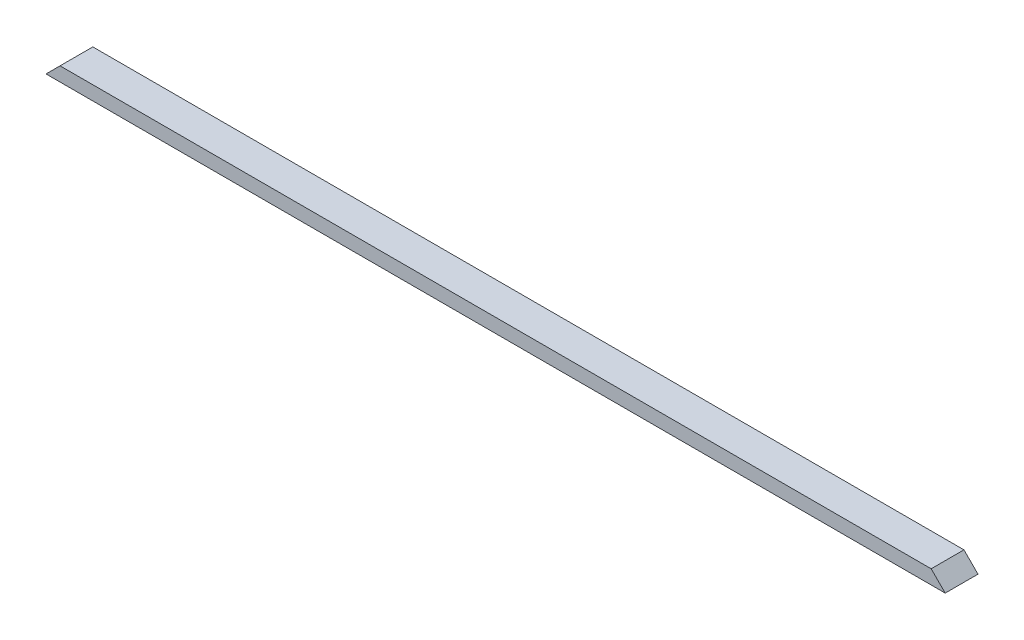
ISO-10303-21;
HEADER;
FILE_DESCRIPTION(('STEP AP214'),'2;1');
FILE_NAME('part.step','',(''),(''),'','','');
FILE_SCHEMA(('AUTOMOTIVE_DESIGN { 1 0 10303 214 1 1 1 1 }'));
ENDSEC;
DATA;
#1=APPLICATION_CONTEXT('core data for automotive mechanical design processes');
#2=APPLICATION_PROTOCOL_DEFINITION('international standard','automotive_design',2000,#1);
#3=PRODUCT_CONTEXT('',#1,'mechanical');
#4=PRODUCT('Part','Part','',(#3));
#5=PRODUCT_RELATED_PRODUCT_CATEGORY('part','',(#4));
#6=PRODUCT_DEFINITION_FORMATION('','',#4);
#7=PRODUCT_DEFINITION_CONTEXT('part definition',#1,'design');
#8=PRODUCT_DEFINITION('design','',#6,#7);
#9=PRODUCT_DEFINITION_SHAPE('','',#8);
#10=(LENGTH_UNIT() NAMED_UNIT(*) SI_UNIT(.MILLI.,.METRE.));
#11=(NAMED_UNIT(*) PLANE_ANGLE_UNIT() SI_UNIT($,.RADIAN.));
#12=(NAMED_UNIT(*) SI_UNIT($,.STERADIAN.) SOLID_ANGLE_UNIT());
#13=UNCERTAINTY_MEASURE_WITH_UNIT(LENGTH_MEASURE(1.E-05),#10,'distance_accuracy_value','');
#14=(GEOMETRIC_REPRESENTATION_CONTEXT(3) GLOBAL_UNCERTAINTY_ASSIGNED_CONTEXT((#13)) GLOBAL_UNIT_ASSIGNED_CONTEXT((#10,
#11,#12)) REPRESENTATION_CONTEXT('',''));
#15=CARTESIAN_POINT('',(0.,0.,0.));
#16=DIRECTION('',(0.,0.,1.));
#17=DIRECTION('',(1.,0.,0.));
#18=AXIS2_PLACEMENT_3D('',#15,#16,#17);
#19=CARTESIAN_POINT('',(0.,38.1,0.));
#20=DIRECTION('',(0.,0.,-1.));
#21=DIRECTION('',(-1.,0.,0.));
#22=AXIS2_PLACEMENT_3D('',#19,#20,#21);
#23=PLANE('',#22);
#24=DIRECTION('',(1.,0.,0.));
#25=VECTOR('',#24,1.);
#26=CARTESIAN_POINT('',(0.,38.1,0.));
#27=LINE('',#26,#25);
#28=CARTESIAN_POINT('',(38.1,38.1,0.));
#29=VERTEX_POINT('',#28);
#30=CARTESIAN_POINT('',(2400.3,38.1000000000001,0.));
#31=VERTEX_POINT('',#30);
#32=EDGE_CURVE('E46',#29,#31,#27,.T.);
#33=ORIENTED_EDGE('',*,*,#32,.F.);
#34=DIRECTION('',(0.707106781186547,0.707106781186547,0.));
#35=VECTOR('',#34,1.);
#36=CARTESIAN_POINT('',(0.,0.,0.));
#37=LINE('',#36,#35);
#38=CARTESIAN_POINT('',(0.,0.,0.));
#39=VERTEX_POINT('',#38);
#40=EDGE_CURVE('E81',#39,#29,#37,.T.);
#41=ORIENTED_EDGE('',*,*,#40,.F.);
#42=DIRECTION('',(1.,0.,0.));
#43=VECTOR('',#42,1.);
#44=CARTESIAN_POINT('',(0.,0.,0.));
#45=LINE('',#44,#43);
#46=CARTESIAN_POINT('',(2438.4,0.,0.));
#47=VERTEX_POINT('',#46);
#48=EDGE_CURVE('E86',#39,#47,#45,.T.);
#49=ORIENTED_EDGE('',*,*,#48,.T.);
#50=DIRECTION('',(0.707106781186547,-0.707106781186548,0.));
#51=VECTOR('',#50,1.);
#52=CARTESIAN_POINT('',(2400.3,38.1000000000001,0.));
#53=LINE('',#52,#51);
#54=EDGE_CURVE('E62',#31,#47,#53,.T.);
#55=ORIENTED_EDGE('',*,*,#54,.F.);
#56=EDGE_LOOP('',(#33,#41,#49,#55));
#57=FACE_BOUND('',#56,.T.);
#58=ADVANCED_FACE('F38',(#57),#23,.F.);
#59=CARTESIAN_POINT('',(0.,38.1,-88.9));
#60=DIRECTION('',(0.,0.,1.));
#61=DIRECTION('',(1.,0.,0.));
#62=AXIS2_PLACEMENT_3D('',#59,#60,#61);
#63=PLANE('',#62);
#64=DIRECTION('',(-1.,0.,0.));
#65=VECTOR('',#64,1.);
#66=CARTESIAN_POINT('',(0.,0.,-88.9));
#67=LINE('',#66,#65);
#68=CARTESIAN_POINT('',(2438.4,0.,-88.9));
#69=VERTEX_POINT('',#68);
#70=CARTESIAN_POINT('',(0.,0.,-88.9));
#71=VERTEX_POINT('',#70);
#72=EDGE_CURVE('E41',#69,#71,#67,.T.);
#73=ORIENTED_EDGE('',*,*,#72,.T.);
#74=DIRECTION('',(0.707106781186547,0.707106781186547,0.));
#75=VECTOR('',#74,1.);
#76=CARTESIAN_POINT('',(0.,0.,-88.9));
#77=LINE('',#76,#75);
#78=CARTESIAN_POINT('',(38.1,38.1,-88.9));
#79=VERTEX_POINT('',#78);
#80=EDGE_CURVE('E54',#71,#79,#77,.T.);
#81=ORIENTED_EDGE('',*,*,#80,.T.);
#82=DIRECTION('',(-1.,0.,0.));
#83=VECTOR('',#82,1.);
#84=CARTESIAN_POINT('',(0.,38.1,-88.9));
#85=LINE('',#84,#83);
#86=CARTESIAN_POINT('',(2400.3,38.1000000000001,-88.9));
#87=VERTEX_POINT('',#86);
#88=EDGE_CURVE('E11',#87,#79,#85,.T.);
#89=ORIENTED_EDGE('',*,*,#88,.F.);
#90=DIRECTION('',(0.707106781186547,-0.707106781186548,0.));
#91=VECTOR('',#90,1.);
#92=CARTESIAN_POINT('',(2400.3,38.1000000000001,-88.9));
#93=LINE('',#92,#91);
#94=EDGE_CURVE('E99',#87,#69,#93,.T.);
#95=ORIENTED_EDGE('',*,*,#94,.T.);
#96=EDGE_LOOP('',(#73,#81,#89,#95));
#97=FACE_BOUND('',#96,.T.);
#98=ADVANCED_FACE('F108',(#97),#63,.F.);
#99=CARTESIAN_POINT('',(0.,38.1,0.));
#100=DIRECTION('',(0.,-1.,0.));
#101=DIRECTION('',(0.,0.,-1.));
#102=AXIS2_PLACEMENT_3D('',#99,#100,#101);
#103=PLANE('',#102);
#104=ORIENTED_EDGE('',*,*,#88,.T.);
#105=DIRECTION('',(0.,0.,1.));
#106=VECTOR('',#105,1.);
#107=CARTESIAN_POINT('',(38.1,38.1,-88.9));
#108=LINE('',#107,#106);
#109=EDGE_CURVE('E87',#79,#29,#108,.T.);
#110=ORIENTED_EDGE('',*,*,#109,.T.);
#111=ORIENTED_EDGE('',*,*,#32,.T.);
#112=DIRECTION('',(0.,0.,1.));
#113=VECTOR('',#112,1.);
#114=CARTESIAN_POINT('',(2400.3,38.1000000000001,-88.9));
#115=LINE('',#114,#113);
#116=EDGE_CURVE('E102',#87,#31,#115,.T.);
#117=ORIENTED_EDGE('',*,*,#116,.F.);
#118=EDGE_LOOP('',(#104,#110,#111,#117));
#119=FACE_BOUND('',#118,.T.);
#120=ADVANCED_FACE('F111',(#119),#103,.F.);
#121=CARTESIAN_POINT('',(0.,0.,0.));
#122=DIRECTION('',(0.,-1.,0.));
#123=DIRECTION('',(0.,0.,-1.));
#124=AXIS2_PLACEMENT_3D('',#121,#122,#123);
#125=PLANE('',#124);
#126=DIRECTION('',(0.,0.,1.));
#127=VECTOR('',#126,1.);
#128=CARTESIAN_POINT('',(0.,0.,0.));
#129=LINE('',#128,#127);
#130=EDGE_CURVE('E78',#71,#39,#129,.T.);
#131=ORIENTED_EDGE('',*,*,#130,.F.);
#132=ORIENTED_EDGE('',*,*,#72,.F.);
#133=DIRECTION('',(0.,0.,-1.));
#134=VECTOR('',#133,1.);
#135=CARTESIAN_POINT('',(2438.4,0.,0.));
#136=LINE('',#135,#134);
#137=EDGE_CURVE('E95',#47,#69,#136,.T.);
#138=ORIENTED_EDGE('',*,*,#137,.F.);
#139=ORIENTED_EDGE('',*,*,#48,.F.);
#140=EDGE_LOOP('',(#131,#132,#138,#139));
#141=FACE_BOUND('',#140,.T.);
#142=ADVANCED_FACE('F94',(#141),#125,.T.);
#143=CARTESIAN_POINT('',(2400.3,38.1000000000001,-88.9));
#144=DIRECTION('',(-0.707106781186548,-0.707106781186547,0.));
#145=DIRECTION('',(0.707106781186547,-0.707106781186548,0.));
#146=AXIS2_PLACEMENT_3D('',#143,#144,#145);
#147=PLANE('',#146);
#148=ORIENTED_EDGE('',*,*,#54,.T.);
#149=ORIENTED_EDGE('',*,*,#137,.T.);
#150=ORIENTED_EDGE('',*,*,#94,.F.);
#151=ORIENTED_EDGE('',*,*,#116,.T.);
#152=EDGE_LOOP('',(#148,#149,#150,#151));
#153=FACE_BOUND('',#152,.T.);
#154=ADVANCED_FACE('F112',(#153),#147,.F.);
#155=CARTESIAN_POINT('',(0.,0.,-88.9));
#156=DIRECTION('',(0.707106781186547,-0.707106781186547,0.));
#157=DIRECTION('',(0.707106781186548,0.707106781186548,0.));
#158=AXIS2_PLACEMENT_3D('',#155,#156,#157);
#159=PLANE('',#158);
#160=ORIENTED_EDGE('',*,*,#40,.T.);
#161=ORIENTED_EDGE('',*,*,#109,.F.);
#162=ORIENTED_EDGE('',*,*,#80,.F.);
#163=ORIENTED_EDGE('',*,*,#130,.T.);
#164=EDGE_LOOP('',(#160,#161,#162,#163));
#165=FACE_BOUND('',#164,.T.);
#166=ADVANCED_FACE('F80',(#165),#159,.F.);
#167=CLOSED_SHELL('',(#58,#98,#120,#142,#154,#166));
#168=MANIFOLD_SOLID_BREP('B2',#167);
#169=ADVANCED_BREP_SHAPE_REPRESENTATION('',(#18,#168),#14);
#170=SHAPE_DEFINITION_REPRESENTATION(#9,#169);
ENDSEC;
END-ISO-10303-21;
